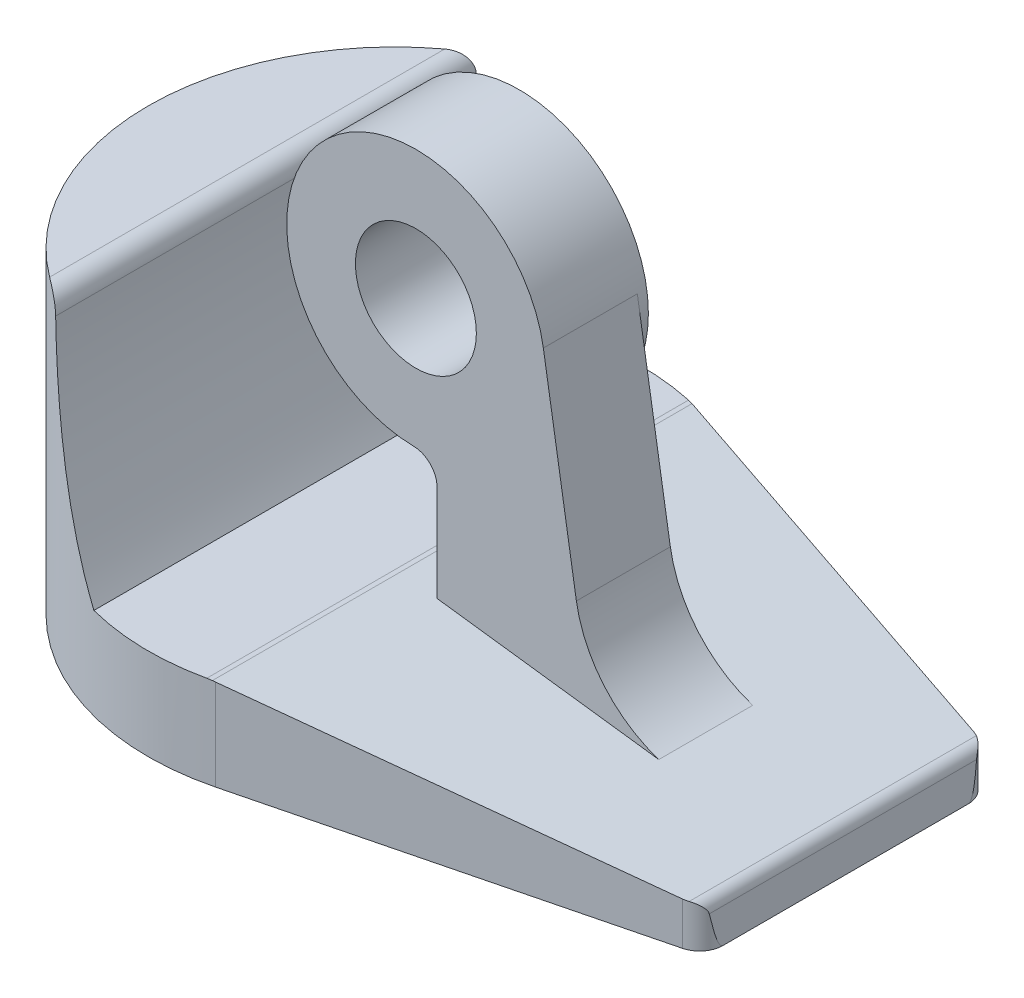
ISO-10303-21;
HEADER;
FILE_DESCRIPTION(('STEP AP214'),'2;1');
FILE_NAME('part.step','',(''),(''),'','','');
FILE_SCHEMA(('AUTOMOTIVE_DESIGN { 1 0 10303 214 1 1 1 1 }'));
ENDSEC;
DATA;
#1=APPLICATION_CONTEXT('core data for automotive mechanical design processes');
#2=APPLICATION_PROTOCOL_DEFINITION('international standard','automotive_design',2000,#1);
#3=PRODUCT_CONTEXT('',#1,'mechanical');
#4=PRODUCT('Part','Part','',(#3));
#5=PRODUCT_RELATED_PRODUCT_CATEGORY('part','',(#4));
#6=PRODUCT_DEFINITION_FORMATION('','',#4);
#7=PRODUCT_DEFINITION_CONTEXT('part definition',#1,'design');
#8=PRODUCT_DEFINITION('design','',#6,#7);
#9=PRODUCT_DEFINITION_SHAPE('','',#8);
#10=(LENGTH_UNIT() NAMED_UNIT(*) SI_UNIT(.MILLI.,.METRE.));
#11=(NAMED_UNIT(*) PLANE_ANGLE_UNIT() SI_UNIT($,.RADIAN.));
#12=(NAMED_UNIT(*) SI_UNIT($,.STERADIAN.) SOLID_ANGLE_UNIT());
#13=UNCERTAINTY_MEASURE_WITH_UNIT(LENGTH_MEASURE(1.E-05),#10,'distance_accuracy_value','');
#14=(GEOMETRIC_REPRESENTATION_CONTEXT(3) GLOBAL_UNCERTAINTY_ASSIGNED_CONTEXT((#13)) GLOBAL_UNIT_ASSIGNED_CONTEXT((#10,
#11,#12)) REPRESENTATION_CONTEXT('',''));
#15=CARTESIAN_POINT('',(0.,0.,0.));
#16=DIRECTION('',(0.,0.,1.));
#17=DIRECTION('',(1.,0.,0.));
#18=AXIS2_PLACEMENT_3D('',#15,#16,#17);
#19=CARTESIAN_POINT('',(18.2,13.5,-5.22027619321904));
#20=DIRECTION('',(0.,-1.,0.));
#21=DIRECTION('',(0.,0.,-1.));
#22=AXIS2_PLACEMENT_3D('',#19,#20,#21);
#23=CYLINDRICAL_SURFACE('',#22,1.);
#24=DIRECTION('',(0.,-1.,0.));
#25=VECTOR('',#24,1.);
#26=CARTESIAN_POINT('',(18.4438049071561,13.5,-6.19010049031962));
#27=LINE('',#26,#25);
#28=CARTESIAN_POINT('',(18.4438049071561,1.82131154060012,-6.19010049031962));
#29=VERTEX_POINT('',#28);
#30=CARTESIAN_POINT('',(18.4438049071561,0.,-6.19010049031962));
#31=VERTEX_POINT('',#30);
#32=EDGE_CURVE('E319',#29,#31,#27,.T.);
#33=ORIENTED_EDGE('',*,*,#32,.F.);
#34=CARTESIAN_POINT('',(18.2,1.85280157355218,-5.22027619321904));
#35=DIRECTION('',(0.128096716222587,0.991761680694001,0.));
#36=DIRECTION('',(0.991761680694001,-0.128096716222587,0.));
#37=AXIS2_PLACEMENT_3D('',#34,#35,#36);
#38=ELLIPSE('',#37,1.00830675298952,1.);
#39=CARTESIAN_POINT('',(18.6484912558825,1.7948740913239,-6.11406341252629));
#40=VERTEX_POINT('',#39);
#41=EDGE_CURVE('E342',#29,#40,#38,.F.);
#42=ORIENTED_EDGE('',*,*,#41,.T.);
#43=CARTESIAN_POINT('',(18.6484912558825,1.7948740913239,-6.11406341252629));
#44=CARTESIAN_POINT('',(18.6802676129442,1.79074901067277,-6.09815542671605));
#45=CARTESIAN_POINT('',(18.7107233065118,1.78373787800668,-6.08071969067226));
#46=CARTESIAN_POINT('',(18.7683849811915,1.76491260999379,-6.04373461692573));
#47=CARTESIAN_POINT('',(18.7956151729706,1.7531376360733,-6.02420344449918));
#48=CARTESIAN_POINT('',(18.8466077166445,1.72573024483383,-5.98379343671604));
#49=CARTESIAN_POINT('',(18.8703874634633,1.71011832770781,-5.96292218530723));
#50=CARTESIAN_POINT('',(18.914685670437,1.67546780161733,-5.92039574203116));
#51=CARTESIAN_POINT('',(18.9351931031517,1.65641804852345,-5.89873818927017));
#52=CARTESIAN_POINT('',(18.9733588637056,1.61454296963424,-5.85492945364332));
#53=CARTESIAN_POINT('',(18.9909198184742,1.5916258373714,-5.83278170476259));
#54=CARTESIAN_POINT('',(19.0223247126766,1.54213890051699,-5.78990524166017));
#55=CARTESIAN_POINT('',(19.0361748928987,1.51557534376584,-5.76917418914955));
#56=CARTESIAN_POINT('',(19.0540893086702,1.4713505568154,-5.74053925191339));
#57=CARTESIAN_POINT('',(19.0597099665848,1.45528980528271,-5.73115181826062));
#58=CARTESIAN_POINT('',(19.0694436228249,1.42177695151179,-5.71440200051831));
#59=CARTESIAN_POINT('',(19.0735654828219,1.40433379542986,-5.70702778010123));
#60=CARTESIAN_POINT('',(19.0780270417698,1.37915850427591,-5.69889461452841));
#61=CARTESIAN_POINT('',(19.0791420216045,1.37197549780757,-5.69684065512729));
#62=CARTESIAN_POINT('',(19.0810733742744,1.3574097308086,-5.69325991760886));
#63=CARTESIAN_POINT('',(19.0818885325434,1.35002628512667,-5.69173528514345));
#64=CARTESIAN_POINT('',(19.082540246817,1.34257112235073,-5.6905130619864));
#65=B_SPLINE_CURVE_WITH_KNOTS('',3,(#43,#44,#45,#46,#47,#48,#49,#50,#51,#52,#53,#54,#55,#56,#57,
#58,#59,#60,#61,#62,#63,#64),.UNSPECIFIED.,.F.,.F.,(4,2,2,2,2,2,2,2,2,2,4),(0.,
0.106921875411762,0.212982096306403,0.31848752408047,0.424341312139109,0.533199185529856,
0.641872815654457,0.7000382821374,0.757854026495124,0.780491057934941,0.803218806704113),.UNSPECIFIED.);
#66=CARTESIAN_POINT('',(19.082540246817,1.34257112235073,-5.69051306198637));
#67=VERTEX_POINT('',#66);
#68=EDGE_CURVE('E290',#40,#67,#65,.T.);
#69=ORIENTED_EDGE('',*,*,#68,.T.);
#70=CARTESIAN_POINT('',(18.2,11.4300523027615,-5.22027619321904));
#71=DIRECTION('',(0.996194698091746,0.0871557427476574,0.));
#72=DIRECTION('',(0.0871557427476574,-0.996194698091746,0.));
#73=AXIS2_PLACEMENT_3D('',#70,#71,#72);
#74=ELLIPSE('',#73,11.47371324567,1.);
#75=CARTESIAN_POINT('',(19.2,0.,-5.22027619321904));
#76=VERTEX_POINT('',#75);
#77=EDGE_CURVE('E224',#67,#76,#74,.F.);
#78=ORIENTED_EDGE('',*,*,#77,.T.);
#79=CARTESIAN_POINT('',(18.2,0.,-5.22027619321904));
#80=DIRECTION('',(0.,1.,0.));
#81=DIRECTION('',(0.,0.,1.));
#82=AXIS2_PLACEMENT_3D('',#79,#80,#81);
#83=CIRCLE('',#82,1.);
#84=EDGE_CURVE('E339',#31,#76,#83,.F.);
#85=ORIENTED_EDGE('',*,*,#84,.F.);
#86=EDGE_LOOP('',(#33,#42,#69,#78,#85));
#87=FACE_BOUND('',#86,.T.);
#88=ADVANCED_FACE('F36',(#87),#23,.T.);
#89=CARTESIAN_POINT('',(2.55995152513875,13.5,-10.183155119556));
#90=DIRECTION('',(0.243804907156071,0.,-0.969824297100573));
#91=DIRECTION('',(-0.969824297100573,0.,-0.243804907156071));
#92=AXIS2_PLACEMENT_3D('',#89,#90,#91);
#93=PLANE('',#92);
#94=DIRECTION('',(0.,-1.,0.));
#95=VECTOR('',#94,1.);
#96=CARTESIAN_POINT('',(2.55995152513875,13.5,-10.183155119556));
#97=LINE('',#96,#95);
#98=CARTESIAN_POINT('',(2.55995152513875,3.87288249641045,-10.183155119556));
#99=VERTEX_POINT('',#98);
#100=CARTESIAN_POINT('',(2.55995152513875,0.,-10.183155119556));
#101=VERTEX_POINT('',#100);
#102=EDGE_CURVE('E311',#99,#101,#97,.T.);
#103=ORIENTED_EDGE('',*,*,#102,.F.);
#104=DIRECTION('',(0.962303981373075,-0.124291936683371,0.241914368959401));
#105=VECTOR('',#104,1.);
#106=CARTESIAN_POINT('',(1.4084844870212,4.02160688180734,-10.4726233409244));
#107=LINE('',#106,#105);
#108=EDGE_CURVE('E312',#99,#29,#107,.T.);
#109=ORIENTED_EDGE('',*,*,#108,.T.);
#110=ORIENTED_EDGE('',*,*,#32,.T.);
#111=DIRECTION('',(0.969824297100573,0.,0.243804907156071));
#112=VECTOR('',#111,1.);
#113=CARTESIAN_POINT('',(2.55995152513875,0.,-10.183155119556));
#114=LINE('',#113,#112);
#115=EDGE_CURVE('E315',#101,#31,#114,.T.);
#116=ORIENTED_EDGE('',*,*,#115,.F.);
#117=EDGE_LOOP('',(#103,#109,#110,#116));
#118=FACE_BOUND('',#117,.T.);
#119=ADVANCED_FACE('F300',(#118),#93,.T.);
#120=CARTESIAN_POINT('',(0.,13.5,0.));
#121=DIRECTION('',(0.,-1.,0.));
#122=DIRECTION('',(0.,0.,-1.));
#123=AXIS2_PLACEMENT_3D('',#120,#121,#122);
#124=CYLINDRICAL_SURFACE('',#123,10.5);
#125=CARTESIAN_POINT('',(-6.28259423957447,13.5,8.41302618686438));
#126=CARTESIAN_POINT('',(-6.22838677976301,13.5000100237203,8.45354789799117));
#127=CARTESIAN_POINT('',(-6.17358027222726,13.4944805880455,8.49361920768717));
#128=CARTESIAN_POINT('',(-6.0645213878592,13.4717295940595,8.57180975410207));
#129=CARTESIAN_POINT('',(-6.01027444403453,13.4544367916504,8.60991556526101));
#130=CARTESIAN_POINT('',(-5.91633017160274,13.4126591942212,8.67465193061006));
#131=CARTESIAN_POINT('',(-5.87604475329094,13.3905732661252,8.70196993223101));
#132=CARTESIAN_POINT('',(-5.79874733441117,13.3387853413211,8.75366611506213));
#133=CARTESIAN_POINT('',(-5.76172582668327,13.3091065180774,8.77805291517515));
#134=CARTESIAN_POINT('',(-5.69762479858476,13.2472557554305,8.81976849149014));
#135=CARTESIAN_POINT('',(-5.66988576236114,13.2161134164486,8.83760751606915));
#136=CARTESIAN_POINT('',(-5.61896505553764,13.1487503936941,8.87007011856827));
#137=CARTESIAN_POINT('',(-5.59578557886508,13.1125272794904,8.88469214896334));
#138=CARTESIAN_POINT('',(-5.55503586872397,13.0355141558403,8.91022794398512));
#139=CARTESIAN_POINT('',(-5.53750268456487,12.9946962625693,8.9211172444018));
#140=CARTESIAN_POINT('',(-5.50934089131604,12.9099113078166,8.93853692311921));
#141=CARTESIAN_POINT('',(-5.4986959706511,12.8659519617818,8.94507760008262));
#142=CARTESIAN_POINT('',(-5.48964422682209,12.8069668124197,8.95063187692149));
#143=CARTESIAN_POINT('',(-5.4878374759623,12.7925897940214,8.95173962239731));
#144=CARTESIAN_POINT('',(-5.48500754406576,12.7637505761031,8.95347392494794));
#145=CARTESIAN_POINT('',(-5.48398326042964,12.7492885254908,8.95410115912999));
#146=CARTESIAN_POINT('',(-5.48335128244866,12.7347950497174,8.95448818823668));
#147=B_SPLINE_CURVE_WITH_KNOTS('',3,(#125,#126,#127,#128,#129,#130,#131,#132,#133,#134,#135,
#136,#137,#138,#139,#140,#141,#142,#143,#144,#145,#146),.UNSPECIFIED.,.F.,.F.,(4,2,2,2,2,2,2,2,
2,2,4),(0.,0.203158079580191,0.407557658697143,0.567270721287266,0.726502037710801,
0.862018752737931,0.997600515810359,1.13405460948635,1.27018438248779,1.31376006553652,
1.35727423086148),.UNSPECIFIED.);
#148=CARTESIAN_POINT('',(-6.28259423957447,13.5,8.41302618686437));
#149=VERTEX_POINT('',#148);
#150=CARTESIAN_POINT('',(-5.48335128244869,12.7347950497174,8.95448818823658));
#151=VERTEX_POINT('',#150);
#152=EDGE_CURVE('E227',#149,#151,#147,.T.);
#153=ORIENTED_EDGE('',*,*,#152,.F.);
#154=CARTESIAN_POINT('',(0.,13.5,0.));
#155=DIRECTION('',(0.,1.,0.));
#156=DIRECTION('',(0.,0.,1.));
#157=AXIS2_PLACEMENT_3D('',#154,#155,#156);
#158=CIRCLE('',#157,10.5);
#159=CARTESIAN_POINT('',(-6.28259423957447,13.5,-8.41302618686438));
#160=VERTEX_POINT('',#159);
#161=EDGE_CURVE('E326',#160,#149,#158,.T.);
#162=ORIENTED_EDGE('',*,*,#161,.F.);
#163=CARTESIAN_POINT('',(-5.48335128244869,12.7347950497174,-8.95448818823658));
#164=CARTESIAN_POINT('',(-5.48423041252916,12.755019421366,-8.95394940677135));
#165=CARTESIAN_POINT('',(-5.48587940913325,12.7751866366907,-8.95293993078877));
#166=CARTESIAN_POINT('',(-5.49068441215923,12.8152646603904,-8.94999409351274));
#167=CARTESIAN_POINT('',(-5.493839841248,12.8351755639962,-8.94805808730692));
#168=CARTESIAN_POINT('',(-5.50547633742162,12.8941197748488,-8.94090684337089));
#169=CARTESIAN_POINT('',(-5.5161379471259,12.9325871702279,-8.93434216722587));
#170=CARTESIAN_POINT('',(-5.54271414443501,13.0068112739797,-8.91787871490065));
#171=CARTESIAN_POINT('',(-5.55862302302979,13.0425708766582,-8.90798356202921));
#172=CARTESIAN_POINT('',(-5.59497373804368,13.1106945638693,-8.8851971356976));
#173=CARTESIAN_POINT('',(-5.61541983676291,13.1430554131928,-8.87230304445991));
#174=CARTESIAN_POINT('',(-5.66130369371461,13.2055555735564,-8.84310009641031));
#175=CARTESIAN_POINT('',(-5.68696031262574,13.2354614096642,-8.82663793120061));
#176=CARTESIAN_POINT('',(-5.74147386934782,13.2905002540825,-8.7912760244573));
#177=CARTESIAN_POINT('',(-5.77033119731696,13.3156326795116,-8.77237598570733));
#178=CARTESIAN_POINT('',(-5.83473412370199,13.3642864542767,-8.72969488276405));
#179=CARTESIAN_POINT('',(-5.8706438628524,13.3870514911532,-8.70560306581393));
#180=CARTESIAN_POINT('',(-5.9444778391105,13.4262424763794,-8.6553559858595));
#181=CARTESIAN_POINT('',(-5.98240510886939,13.4426585563957,-8.62919758610136));
#182=CARTESIAN_POINT('',(-6.06389884605276,13.4708745863564,-8.57215666017704));
#183=CARTESIAN_POINT('',(-6.10759942029934,13.4818930768423,-8.54108233429341));
#184=CARTESIAN_POINT('',(-6.19517440014582,13.4964410423102,-8.47778237033666));
#185=CARTESIAN_POINT('',(-6.23904757319125,13.4999979432651,-8.44556139282195));
#186=CARTESIAN_POINT('',(-6.28259423957447,13.5,-8.41302618686437));
#187=B_SPLINE_CURVE_WITH_KNOTS('',3,(#163,#164,#165,#166,#167,#168,#169,#170,#171,#172,#173,
#174,#175,#176,#177,#178,#179,#180,#181,#182,#183,#184,#185,#186),.UNSPECIFIED.,.F.,.F.,(4,2,2,
2,2,2,2,2,2,2,2,4),(0.,0.060710509345558,0.121397770330857,0.242112806859486,0.362696936717223,
0.483394827428391,0.611007297422337,0.738635340178701,0.884687516082472,1.03096580063039,
1.19464556912115,1.35772265110047),.UNSPECIFIED.);
#188=CARTESIAN_POINT('',(-5.48335128244869,12.7347950497174,-8.95448818823658));
#189=VERTEX_POINT('',#188);
#190=EDGE_CURVE('E234',#189,#160,#187,.T.);
#191=ORIENTED_EDGE('',*,*,#190,.F.);
#192=CARTESIAN_POINT('',(-2.65,3.9,-10.1600935035067));
#193=CARTESIAN_POINT('',(-2.89237739770949,4.27225938122749,-10.096842857572));
#194=CARTESIAN_POINT('',(-3.12020843354723,4.65296504188959,-10.0281883219219));
#195=CARTESIAN_POINT('',(-3.54616903615586,5.4298041194384,-9.88561120247265));
#196=CARTESIAN_POINT('',(-3.74429320026349,5.82594032615018,-9.81168766402008));
#197=CARTESIAN_POINT('',(-4.10633333468622,6.62364573315424,-9.66567564937164));
#198=CARTESIAN_POINT('',(-4.27087577447494,7.02492998930813,-9.59358101751967));
#199=CARTESIAN_POINT('',(-4.57011468528249,7.83933215007696,-9.4546967965165));
#200=CARTESIAN_POINT('',(-4.70481698078757,8.2524477275319,-9.38790617371347));
#201=CARTESIAN_POINT('',(-4.91733449023907,8.99691379841309,-9.27797400479081));
#202=CARTESIAN_POINT('',(-5.00114559212044,9.32627139434346,-9.23286154957257));
#203=CARTESIAN_POINT('',(-5.14970901358315,9.99021105591854,-9.15083097489157));
#204=CARTESIAN_POINT('',(-5.21446535043033,10.3247920046512,-9.11391112860683));
#205=CARTESIAN_POINT('',(-5.32543800465306,11.0036088684344,-9.04952574659564));
#206=CARTESIAN_POINT('',(-5.37133519011071,11.3479132812729,-9.02222398317647));
#207=CARTESIAN_POINT('',(-5.42487079988006,11.8665469645826,-8.99006080657434));
#208=CARTESIAN_POINT('',(-5.44016704931032,12.0398503488597,-8.98080291445126));
#209=CARTESIAN_POINT('',(-5.46562031250365,12.3869775956263,-8.9653332162485));
#210=CARTESIAN_POINT('',(-5.47577708369301,12.5608014822932,-8.95912155394556));
#211=CARTESIAN_POINT('',(-5.48335128244869,12.7347950497174,-8.95448818823664));
#212=B_SPLINE_CURVE_WITH_KNOTS('',3,(#192,#193,#194,#195,#196,#197,#198,#199,#200,#201,#202,
#203,#204,#205,#206,#207,#208,#209,#210,#211),.UNSPECIFIED.,.F.,.F.,(4,2,2,2,2,2,2,2,2,4),(0.,
1.34561648499748,2.69147739552455,4.00931041819144,5.32688598644845,6.35477391978285,
7.38244499069429,8.42685338909804,8.94943316685275,9.47203760709035),.UNSPECIFIED.);
#213=CARTESIAN_POINT('',(-2.65,3.9,-10.1600935035067));
#214=VERTEX_POINT('',#213);
#215=EDGE_CURVE('E366',#214,#189,#212,.T.);
#216=ORIENTED_EDGE('',*,*,#215,.F.);
#217=CARTESIAN_POINT('',(0.,3.9,0.));
#218=DIRECTION('',(0.,1.,0.));
#219=DIRECTION('',(-1.,0.,0.));
#220=AXIS2_PLACEMENT_3D('',#217,#218,#219);
#221=CIRCLE('',#220,10.5);
#222=CARTESIAN_POINT('',(2.25353008786326,3.9,-10.2553206748056));
#223=VERTEX_POINT('',#222);
#224=EDGE_CURVE('E362',#223,#214,#221,.T.);
#225=ORIENTED_EDGE('',*,*,#224,.F.);
#226=CARTESIAN_POINT('',(2.44567516219714,3.887642521041,-10.2112033081813));
#227=CARTESIAN_POINT('',(2.41384546311767,3.8917555558298,-10.2188280421213));
#228=CARTESIAN_POINT('',(2.38191852405007,3.89484186313745,-10.2263168563101));
#229=CARTESIAN_POINT('',(2.31787016593878,3.89896102279045,-10.2410226451848));
#230=CARTESIAN_POINT('',(2.28574874689508,3.8999938751358,-10.2482396198709));
#231=CARTESIAN_POINT('',(2.25353008786326,3.90000000000001,-10.2553206748056));
#232=B_SPLINE_CURVE_WITH_KNOTS('',3,(#226,#227,#228,#229,#230,#231),.UNSPECIFIED.,.F.,.F.,(4,2,
4),(0.,0.0988151487414125,0.19763029748241),.UNSPECIFIED.);
#233=CARTESIAN_POINT('',(2.44567516219714,3.887642521041,-10.2112033081813));
#234=VERTEX_POINT('',#233);
#235=EDGE_CURVE('E361',#234,#223,#232,.T.);
#236=ORIENTED_EDGE('',*,*,#235,.F.);
#237=CARTESIAN_POINT('',(0.,4.20352784240709,0.));
#238=DIRECTION('',(0.128096716222587,0.991761680694001,0.));
#239=DIRECTION('',(0.991761680694001,-0.128096716222587,0.));
#240=AXIS2_PLACEMENT_3D('',#237,#238,#239);
#241=ELLIPSE('',#240,10.58722090639,10.5);
#242=EDGE_CURVE('E346',#99,#234,#241,.T.);
#243=ORIENTED_EDGE('',*,*,#242,.F.);
#244=ORIENTED_EDGE('',*,*,#102,.T.);
#245=CARTESIAN_POINT('',(0.,0.,0.));
#246=DIRECTION('',(0.,1.,0.));
#247=DIRECTION('',(0.,0.,1.));
#248=AXIS2_PLACEMENT_3D('',#245,#246,#247);
#249=CIRCLE('',#248,10.5);
#250=CARTESIAN_POINT('',(2.55995152513875,0.,10.183155119556));
#251=VERTEX_POINT('',#250);
#252=EDGE_CURVE('E336',#101,#251,#249,.T.);
#253=ORIENTED_EDGE('',*,*,#252,.T.);
#254=DIRECTION('',(0.,-1.,0.));
#255=VECTOR('',#254,1.);
#256=CARTESIAN_POINT('',(2.55995152513875,13.5,10.183155119556));
#257=LINE('',#256,#255);
#258=CARTESIAN_POINT('',(2.55995152513875,3.87288249641045,10.183155119556));
#259=VERTEX_POINT('',#258);
#260=EDGE_CURVE('E320',#259,#251,#257,.T.);
#261=ORIENTED_EDGE('',*,*,#260,.F.);
#262=CARTESIAN_POINT('',(2.44567516219714,3.887642521041,10.2112033081813));
#263=VERTEX_POINT('',#262);
#264=EDGE_CURVE('E347',#263,#259,#241,.T.);
#265=ORIENTED_EDGE('',*,*,#264,.F.);
#266=CARTESIAN_POINT('',(2.25353008786326,3.9,10.2553206748056));
#267=CARTESIAN_POINT('',(2.28574874689508,3.89999387513579,10.2482396198709));
#268=CARTESIAN_POINT('',(2.31787016593878,3.89896102279044,10.2410226451848));
#269=CARTESIAN_POINT('',(2.38191852405007,3.89484186313746,10.2263168563101));
#270=CARTESIAN_POINT('',(2.41384546311767,3.8917555558298,10.2188280421213));
#271=CARTESIAN_POINT('',(2.44567516219714,3.887642521041,10.2112033081813));
#272=B_SPLINE_CURVE_WITH_KNOTS('',3,(#266,#267,#268,#269,#270,#271),.UNSPECIFIED.,.F.,.F.,(4,2,
4),(0.,0.0988151487409988,0.197630297482412),.UNSPECIFIED.);
#273=CARTESIAN_POINT('',(2.25353008786326,3.9,10.2553206748056));
#274=VERTEX_POINT('',#273);
#275=EDGE_CURVE('E379',#274,#263,#272,.T.);
#276=ORIENTED_EDGE('',*,*,#275,.F.);
#277=CARTESIAN_POINT('',(-2.65,3.9,10.1600935035067));
#278=VERTEX_POINT('',#277);
#279=EDGE_CURVE('E368',#278,#274,#221,.T.);
#280=ORIENTED_EDGE('',*,*,#279,.F.);
#281=CARTESIAN_POINT('',(-5.48335128244869,12.7347950497174,8.95448818823657));
#282=CARTESIAN_POINT('',(-5.47355702550274,12.5097130886613,8.96046903611428));
#283=CARTESIAN_POINT('',(-5.45943355604728,12.2848996478618,8.96911200117412));
#284=CARTESIAN_POINT('',(-5.4226006640974,11.8362515155291,8.99143730121418));
#285=CARTESIAN_POINT('',(-5.39989216370003,11.6124167214928,9.00511909498214));
#286=CARTESIAN_POINT('',(-5.3459839753329,11.1663212124301,9.03722404669327));
#287=CARTESIAN_POINT('',(-5.31479199767201,10.9440592552043,9.05564289848245));
#288=CARTESIAN_POINT('',(-5.24400931068921,10.5012921407416,9.09681464683853));
#289=CARTESIAN_POINT('',(-5.20441844309455,10.2807870166925,9.11956762507899));
#290=CARTESIAN_POINT('',(-5.07496904058514,9.63127224626168,9.1926301608044));
#291=CARTESIAN_POINT('',(-4.97332283334207,9.20516839002024,9.24843595077005));
#292=CARTESIAN_POINT('',(-4.73905648125785,8.36314859530489,9.37063191089226));
#293=CARTESIAN_POINT('',(-4.60643293961607,7.94723377963411,9.43702324154624));
#294=CARTESIAN_POINT('',(-4.34463378914422,7.22049415818097,9.55981307124812));
#295=CARTESIAN_POINT('',(-4.22152564938398,6.90726949757299,9.61505311529336));
#296=CARTESIAN_POINT('',(-3.95767028549549,6.28862100802398,9.72663124469442));
#297=CARTESIAN_POINT('',(-3.81692713140902,5.98319539863152,9.78296907416332));
#298=CARTESIAN_POINT('',(-3.51567590165147,5.37588183878299,9.89526610507305));
#299=CARTESIAN_POINT('',(-3.35488693746412,5.07412927381155,9.95120472862685));
#300=CARTESIAN_POINT('',(-3.01562625287824,4.47989999746502,10.0592066036168));
#301=CARTESIAN_POINT('',(-2.83714921274317,4.18742611180409,10.1112686808761));
#302=CARTESIAN_POINT('',(-2.65,3.9,10.1600935035067));
#303=B_SPLINE_CURVE_WITH_KNOTS('',3,(#281,#282,#283,#284,#285,#286,#287,#288,#289,#290,#291,
#292,#293,#294,#295,#296,#297,#298,#299,#300,#301,#302),.UNSPECIFIED.,.F.,.F.,(4,2,2,2,2,2,2,2,
2,2,4),(0.,0.676051307687673,1.35203002298913,2.02739640829444,2.70277552166311,
4.02605496876232,5.3494795874364,6.3721095701907,7.39450397010714,8.4333022558415,
9.47241391656499),.UNSPECIFIED.);
#304=EDGE_CURVE('E387',#151,#278,#303,.T.);
#305=ORIENTED_EDGE('',*,*,#304,.F.);
#306=EDGE_LOOP('',(#153,#162,#191,#216,#225,#236,#243,#244,#253,#261,#265,#276,#280,#305));
#307=FACE_BOUND('',#306,.T.);
#308=ADVANCED_FACE('F239',(#307),#124,.T.);
#309=CARTESIAN_POINT('',(2.55995152513874,13.5,10.183155119556));
#310=DIRECTION('',(0.243804907156071,0.,0.969824297100573));
#311=DIRECTION('',(0.969824297100573,0.,-0.243804907156071));
#312=AXIS2_PLACEMENT_3D('',#309,#310,#311);
#313=PLANE('',#312);
#314=DIRECTION('',(0.,-1.,0.));
#315=VECTOR('',#314,1.);
#316=CARTESIAN_POINT('',(18.4438049071561,13.5,6.19010049031961));
#317=LINE('',#316,#315);
#318=CARTESIAN_POINT('',(18.4438049071561,1.82131154060012,6.19010049031961));
#319=VERTEX_POINT('',#318);
#320=CARTESIAN_POINT('',(18.4438049071561,0.,6.19010049031961));
#321=VERTEX_POINT('',#320);
#322=EDGE_CURVE('E322',#319,#321,#317,.T.);
#323=ORIENTED_EDGE('',*,*,#322,.F.);
#324=DIRECTION('',(-0.962303981373075,0.124291936683371,0.241914368959401));
#325=VECTOR('',#324,1.);
#326=CARTESIAN_POINT('',(1.4084844870212,4.02160688180734,10.4726233409244));
#327=LINE('',#326,#325);
#328=EDGE_CURVE('E296',#319,#259,#327,.T.);
#329=ORIENTED_EDGE('',*,*,#328,.T.);
#330=ORIENTED_EDGE('',*,*,#260,.T.);
#331=DIRECTION('',(-0.969824297100573,0.,0.243804907156071));
#332=VECTOR('',#331,1.);
#333=CARTESIAN_POINT('',(2.55995152513874,0.,10.183155119556));
#334=LINE('',#333,#332);
#335=EDGE_CURVE('E333',#321,#251,#334,.T.);
#336=ORIENTED_EDGE('',*,*,#335,.F.);
#337=EDGE_LOOP('',(#323,#329,#330,#336));
#338=FACE_BOUND('',#337,.T.);
#339=ADVANCED_FACE('F266',(#338),#313,.T.);
#340=CARTESIAN_POINT('',(18.2,13.5,5.22027619321904));
#341=DIRECTION('',(0.,-1.,0.));
#342=DIRECTION('',(0.,0.,-1.));
#343=AXIS2_PLACEMENT_3D('',#340,#341,#342);
#344=CYLINDRICAL_SURFACE('',#343,1.);
#345=CARTESIAN_POINT('',(19.082540246817,1.34257112235073,5.69051306198639));
#346=CARTESIAN_POINT('',(19.0809217445931,1.36107915597881,5.69354632465262));
#347=CARTESIAN_POINT('',(19.0783158791309,1.37900287021135,5.69840941516929));
#348=CARTESIAN_POINT('',(19.0715037512144,1.41332591120479,5.71071473998299));
#349=CARTESIAN_POINT('',(19.067322754372,1.42974446360726,5.71811609971433));
#350=CARTESIAN_POINT('',(19.0549360824653,1.47018593386494,5.73922089576665));
#351=CARTESIAN_POINT('',(19.0457912064813,1.49326311188743,5.754122119124));
#352=CARTESIAN_POINT('',(19.0248583580397,1.53695263491911,5.78594387194478));
#353=CARTESIAN_POINT('',(19.0130446146178,1.55753772080748,5.80288328230811));
#354=CARTESIAN_POINT('',(18.9802745200936,1.60654092260777,5.84657696165573));
#355=CARTESIAN_POINT('',(18.9577594653274,1.63346162219039,5.8738520200305));
#356=CARTESIAN_POINT('',(18.907497412463,1.68220680877197,5.92795796913642));
#357=CARTESIAN_POINT('',(18.8797633040418,1.70404356067174,5.95478978065132));
#358=CARTESIAN_POINT('',(18.8250436447169,1.73824020320685,6.00152605392535));
#359=CARTESIAN_POINT('',(18.7989762840012,1.75161863027937,6.02175769190956));
#360=CARTESIAN_POINT('',(18.7437035406087,1.7738796306368,6.06022178286835));
#361=CARTESIAN_POINT('',(18.7145095255076,1.78277786191102,6.07846102159924));
#362=CARTESIAN_POINT('',(18.6723720667144,1.79134572355424,6.10177879695792));
#363=CARTESIAN_POINT('',(18.6605157717982,1.79332194980747,6.10803405133317));
#364=CARTESIAN_POINT('',(18.6484912558825,1.7948740913239,6.11406341252628));
#365=B_SPLINE_CURVE_WITH_KNOTS('',3,(#345,#346,#347,#348,#349,#350,#351,#352,#353,#354,#355,
#356,#357,#358,#359,#360,#361,#362,#363,#364),.UNSPECIFIED.,.F.,.F.,(4,2,2,2,2,2,2,2,2,4),(0.,
0.0560702876294425,0.111277043087514,0.197680626412082,0.284957186739713,0.417645733970969,
0.550010777251174,0.656439151311666,0.762492937438157,0.803112015267204),.UNSPECIFIED.);
#366=CARTESIAN_POINT('',(19.082540246817,1.34257112235073,5.69051306198642));
#367=VERTEX_POINT('',#366);
#368=CARTESIAN_POINT('',(18.6484912558825,1.7948740913239,6.11406341252628));
#369=VERTEX_POINT('',#368);
#370=EDGE_CURVE('E269',#367,#369,#365,.T.);
#371=ORIENTED_EDGE('',*,*,#370,.T.);
#372=CARTESIAN_POINT('',(18.2,1.85280157355218,5.22027619321904));
#373=DIRECTION('',(0.128096716222587,0.991761680694001,0.));
#374=DIRECTION('',(0.991761680694001,-0.128096716222587,0.));
#375=AXIS2_PLACEMENT_3D('',#372,#373,#374);
#376=ELLIPSE('',#375,1.00830675298952,1.);
#377=EDGE_CURVE('E277',#369,#319,#376,.F.);
#378=ORIENTED_EDGE('',*,*,#377,.T.);
#379=ORIENTED_EDGE('',*,*,#322,.T.);
#380=CARTESIAN_POINT('',(18.2,0.,5.22027619321904));
#381=DIRECTION('',(0.,1.,0.));
#382=DIRECTION('',(0.,0.,1.));
#383=AXIS2_PLACEMENT_3D('',#380,#381,#382);
#384=CIRCLE('',#383,1.);
#385=CARTESIAN_POINT('',(19.2,0.,5.22027619321904));
#386=VERTEX_POINT('',#385);
#387=EDGE_CURVE('E330',#386,#321,#384,.F.);
#388=ORIENTED_EDGE('',*,*,#387,.F.);
#389=CARTESIAN_POINT('',(18.2,11.4300523027615,5.22027619321904));
#390=DIRECTION('',(0.996194698091746,0.0871557427476574,0.));
#391=DIRECTION('',(0.0871557427476574,-0.996194698091746,0.));
#392=AXIS2_PLACEMENT_3D('',#389,#390,#391);
#393=ELLIPSE('',#392,11.47371324567,1.);
#394=EDGE_CURVE('E221',#386,#367,#393,.F.);
#395=ORIENTED_EDGE('',*,*,#394,.T.);
#396=EDGE_LOOP('',(#371,#378,#379,#388,#395));
#397=FACE_BOUND('',#396,.T.);
#398=ADVANCED_FACE('F259',(#397),#344,.T.);
#399=CARTESIAN_POINT('',(0.,13.5,0.));
#400=DIRECTION('',(0.,1.,0.));
#401=DIRECTION('',(0.,0.,1.));
#402=AXIS2_PLACEMENT_3D('',#399,#400,#401);
#403=PLANE('',#402);
#404=ORIENTED_EDGE('',*,*,#161,.T.);
#405=DIRECTION('',(0.,0.,-1.));
#406=VECTOR('',#405,1.);
#407=CARTESIAN_POINT('',(-6.28259423957447,13.5,56.2360147614063));
#408=LINE('',#407,#406);
#409=EDGE_CURVE('E278',#149,#160,#408,.T.);
#410=ORIENTED_EDGE('',*,*,#409,.T.);
#411=EDGE_LOOP('',(#404,#410));
#412=FACE_BOUND('',#411,.T.);
#413=ADVANCED_FACE('F254',(#412),#403,.T.);
#414=CARTESIAN_POINT('',(0.,0.,0.));
#415=DIRECTION('',(0.,1.,0.));
#416=DIRECTION('',(0.,0.,1.));
#417=AXIS2_PLACEMENT_3D('',#414,#415,#416);
#418=PLANE('',#417);
#419=ORIENTED_EDGE('',*,*,#84,.T.);
#420=DIRECTION('',(0.,0.,1.));
#421=VECTOR('',#420,1.);
#422=CARTESIAN_POINT('',(19.2,0.,0.));
#423=LINE('',#422,#421);
#424=EDGE_CURVE('E327',#76,#386,#423,.T.);
#425=ORIENTED_EDGE('',*,*,#424,.T.);
#426=ORIENTED_EDGE('',*,*,#387,.T.);
#427=ORIENTED_EDGE('',*,*,#335,.T.);
#428=ORIENTED_EDGE('',*,*,#252,.F.);
#429=ORIENTED_EDGE('',*,*,#115,.T.);
#430=EDGE_LOOP('',(#419,#425,#426,#427,#428,#429));
#431=FACE_BOUND('',#430,.T.);
#432=ADVANCED_FACE('F258',(#431),#418,.F.);
#433=CARTESIAN_POINT('',(12.0934210526316,13.5,56.2360147614063));
#434=DIRECTION('',(0.,0.,-1.));
#435=DIRECTION('',(-1.,0.,0.));
#436=AXIS2_PLACEMENT_3D('',#433,#434,#435);
#437=CYLINDRICAL_SURFACE('',#436,17.5934210526316);
#438=DIRECTION('',(0.,0.,-1.));
#439=VECTOR('',#438,1.);
#440=CARTESIAN_POINT('',(-5.48335128244869,12.7347950497174,56.2360147614063));
#441=LINE('',#440,#439);
#442=EDGE_CURVE('E218',#151,#189,#441,.T.);
#443=ORIENTED_EDGE('',*,*,#442,.F.);
#444=ORIENTED_EDGE('',*,*,#304,.T.);
#445=DIRECTION('',(0.,0.,-1.));
#446=VECTOR('',#445,1.);
#447=CARTESIAN_POINT('',(-2.65,3.90000000000001,56.2360147614063));
#448=LINE('',#447,#446);
#449=EDGE_CURVE('E215',#278,#214,#448,.T.);
#450=ORIENTED_EDGE('',*,*,#449,.T.);
#451=ORIENTED_EDGE('',*,*,#215,.T.);
#452=EDGE_LOOP('',(#443,#444,#450,#451));
#453=FACE_BOUND('',#452,.T.);
#454=ADVANCED_FACE('F251',(#453),#437,.F.);
#455=CARTESIAN_POINT('',(-2.65,3.9,56.2360147614063));
#456=DIRECTION('',(0.,1.,0.));
#457=DIRECTION('',(-1.,0.,0.));
#458=AXIS2_PLACEMENT_3D('',#455,#456,#457);
#459=PLANE('',#458);
#460=ORIENTED_EDGE('',*,*,#449,.F.);
#461=ORIENTED_EDGE('',*,*,#279,.T.);
#462=DIRECTION('',(0.,0.,-1.));
#463=VECTOR('',#462,1.);
#464=CARTESIAN_POINT('',(2.25353008786326,3.9,56.2360147614063));
#465=LINE('',#464,#463);
#466=EDGE_CURVE('E212',#274,#223,#465,.T.);
#467=ORIENTED_EDGE('',*,*,#466,.T.);
#468=ORIENTED_EDGE('',*,*,#224,.T.);
#469=EDGE_LOOP('',(#460,#461,#467,#468));
#470=FACE_BOUND('',#469,.T.);
#471=ADVANCED_FACE('F376',(#470),#459,.T.);
#472=CARTESIAN_POINT('',(2.25353008786326,2.4,56.2360147614063));
#473=DIRECTION('',(0.,0.,-1.));
#474=DIRECTION('',(-1.,0.,0.));
#475=AXIS2_PLACEMENT_3D('',#472,#473,#474);
#476=CYLINDRICAL_SURFACE('',#475,1.5);
#477=DIRECTION('',(0.,0.,-1.));
#478=VECTOR('',#477,1.);
#479=CARTESIAN_POINT('',(2.44567516219714,3.887642521041,56.2360147614063));
#480=LINE('',#479,#478);
#481=EDGE_CURVE('E209',#263,#234,#480,.T.);
#482=ORIENTED_EDGE('',*,*,#481,.T.);
#483=ORIENTED_EDGE('',*,*,#235,.T.);
#484=ORIENTED_EDGE('',*,*,#466,.F.);
#485=ORIENTED_EDGE('',*,*,#275,.T.);
#486=EDGE_LOOP('',(#482,#483,#484,#485));
#487=FACE_BOUND('',#486,.T.);
#488=ADVANCED_FACE('F373',(#487),#476,.T.);
#489=CARTESIAN_POINT('',(2.44567516219714,3.887642521041,56.2360147614063));
#490=DIRECTION('',(0.128096716222587,0.991761680694001,0.));
#491=DIRECTION('',(-0.991761680694001,0.128096716222587,0.));
#492=AXIS2_PLACEMENT_3D('',#489,#490,#491);
#493=PLANE('',#492);
#494=DIRECTION('',(0.991761680694001,-0.128096716222587,0.));
#495=VECTOR('',#494,1.);
#496=CARTESIAN_POINT('',(2.44567516219714,3.887642521041,2.2));
#497=LINE('',#496,#495);
#498=CARTESIAN_POINT('',(4.,3.68688470639502,2.2));
#499=VERTEX_POINT('',#498);
#500=CARTESIAN_POINT('',(13.4429189999899,2.46722988507934,2.2));
#501=VERTEX_POINT('',#500);
#502=EDGE_CURVE('E398',#499,#501,#497,.T.);
#503=ORIENTED_EDGE('',*,*,#502,.F.);
#504=DIRECTION('',(0.,0.,-1.));
#505=VECTOR('',#504,1.);
#506=CARTESIAN_POINT('',(4.,3.68688470639502,56.2360147614063));
#507=LINE('',#506,#505);
#508=CARTESIAN_POINT('',(4.,3.68688470639502,-1.8));
#509=VERTEX_POINT('',#508);
#510=EDGE_CURVE('E394',#499,#509,#507,.T.);
#511=ORIENTED_EDGE('',*,*,#510,.T.);
#512=DIRECTION('',(0.991761680694001,-0.128096716222587,0.));
#513=VECTOR('',#512,1.);
#514=CARTESIAN_POINT('',(2.44567516219714,3.887642521041,-1.8));
#515=LINE('',#514,#513);
#516=CARTESIAN_POINT('',(13.4429189999899,2.46722988507934,-1.8));
#517=VERTEX_POINT('',#516);
#518=EDGE_CURVE('E392',#509,#517,#515,.T.);
#519=ORIENTED_EDGE('',*,*,#518,.T.);
#520=DIRECTION('',(0.,0.,-1.));
#521=VECTOR('',#520,1.);
#522=CARTESIAN_POINT('',(13.4429189999899,2.46722988507934,2.2));
#523=LINE('',#522,#521);
#524=EDGE_CURVE('E183',#501,#517,#523,.T.);
#525=ORIENTED_EDGE('',*,*,#524,.F.);
#526=EDGE_LOOP('',(#503,#511,#519,#525));
#527=FACE_BOUND('',#526,.T.);
#528=ORIENTED_EDGE('',*,*,#41,.F.);
#529=ORIENTED_EDGE('',*,*,#108,.F.);
#530=ORIENTED_EDGE('',*,*,#242,.T.);
#531=ORIENTED_EDGE('',*,*,#481,.F.);
#532=ORIENTED_EDGE('',*,*,#264,.T.);
#533=ORIENTED_EDGE('',*,*,#328,.F.);
#534=ORIENTED_EDGE('',*,*,#377,.F.);
#535=DIRECTION('',(0.,0.,-1.));
#536=VECTOR('',#535,1.);
#537=CARTESIAN_POINT('',(18.6484912558825,1.7948740913239,56.2360147614063));
#538=LINE('',#537,#536);
#539=EDGE_CURVE('E206',#369,#40,#538,.T.);
#540=ORIENTED_EDGE('',*,*,#539,.T.);
#541=EDGE_LOOP('',(#528,#529,#530,#531,#532,#533,#534,#540));
#542=FACE_BOUND('',#541,.T.);
#543=ADVANCED_FACE('F249',(#527,#542),#493,.T.);
#544=CARTESIAN_POINT('',(-6.28259423957447,12.7,56.2360147614063));
#545=DIRECTION('',(0.,0.,-1.));
#546=DIRECTION('',(-1.,0.,0.));
#547=AXIS2_PLACEMENT_3D('',#544,#545,#546);
#548=CYLINDRICAL_SURFACE('',#547,0.799999999999998);
#549=ORIENTED_EDGE('',*,*,#442,.T.);
#550=ORIENTED_EDGE('',*,*,#190,.T.);
#551=ORIENTED_EDGE('',*,*,#409,.F.);
#552=ORIENTED_EDGE('',*,*,#152,.T.);
#553=EDGE_LOOP('',(#549,#550,#551,#552));
#554=FACE_BOUND('',#553,.T.);
#555=ADVANCED_FACE('F243',(#554),#548,.T.);
#556=CARTESIAN_POINT('',(18.5844428977712,1.2989932509769,56.2360147614063));
#557=DIRECTION('',(0.,0.,-1.));
#558=DIRECTION('',(-1.,0.,0.));
#559=AXIS2_PLACEMENT_3D('',#556,#557,#558);
#560=CYLINDRICAL_SURFACE('',#559,0.500000000000001);
#561=ORIENTED_EDGE('',*,*,#68,.F.);
#562=ORIENTED_EDGE('',*,*,#539,.F.);
#563=ORIENTED_EDGE('',*,*,#370,.F.);
#564=DIRECTION('',(0.,0.,-1.));
#565=VECTOR('',#564,1.);
#566=CARTESIAN_POINT('',(19.082540246817,1.34257112235073,56.2360147614063));
#567=LINE('',#566,#565);
#568=EDGE_CURVE('E170',#367,#67,#567,.T.);
#569=ORIENTED_EDGE('',*,*,#568,.T.);
#570=EDGE_LOOP('',(#561,#562,#563,#569));
#571=FACE_BOUND('',#570,.T.);
#572=ADVANCED_FACE('F248',(#571),#560,.T.);
#573=CARTESIAN_POINT('',(19.082540246817,1.34257112235073,56.2360147614063));
#574=DIRECTION('',(0.996194698091746,0.0871557427476574,0.));
#575=DIRECTION('',(-0.0871557427476574,0.996194698091746,0.));
#576=AXIS2_PLACEMENT_3D('',#573,#574,#575);
#577=PLANE('',#576);
#578=ORIENTED_EDGE('',*,*,#77,.F.);
#579=ORIENTED_EDGE('',*,*,#568,.F.);
#580=ORIENTED_EDGE('',*,*,#394,.F.);
#581=ORIENTED_EDGE('',*,*,#424,.F.);
#582=EDGE_LOOP('',(#578,#579,#580,#581));
#583=FACE_BOUND('',#582,.T.);
#584=ADVANCED_FACE('F285',(#583),#577,.T.);
#585=CARTESIAN_POINT('',(15.0481403663513,7.39365516579373,2.2));
#586=DIRECTION('',(0.,0.,-1.));
#587=DIRECTION('',(-1.,0.,0.));
#588=AXIS2_PLACEMENT_3D('',#585,#586,#587);
#589=CYLINDRICAL_SURFACE('',#588,5.18135133739115);
#590=CARTESIAN_POINT('',(15.0481403663513,7.39365516579373,2.2));
#591=DIRECTION('',(0.,0.,1.));
#592=DIRECTION('',(1.,0.,0.));
#593=AXIS2_PLACEMENT_3D('',#590,#591,#592);
#594=CIRCLE('',#593,5.18135133739115);
#595=CARTESIAN_POINT('',(9.93428712006275,6.56004455111279,2.2));
#596=VERTEX_POINT('',#595);
#597=EDGE_CURVE('E193',#596,#501,#594,.T.);
#598=ORIENTED_EDGE('',*,*,#597,.T.);
#599=ORIENTED_EDGE('',*,*,#524,.T.);
#600=CARTESIAN_POINT('',(15.0481403663513,7.39365516579373,-1.8));
#601=DIRECTION('',(0.,0.,1.));
#602=DIRECTION('',(1.,0.,0.));
#603=AXIS2_PLACEMENT_3D('',#600,#601,#602);
#604=CIRCLE('',#603,5.18135133739115);
#605=CARTESIAN_POINT('',(9.93428712006275,6.56004455111279,-1.8));
#606=VERTEX_POINT('',#605);
#607=EDGE_CURVE('E177',#606,#517,#604,.T.);
#608=ORIENTED_EDGE('',*,*,#607,.F.);
#609=DIRECTION('',(0.,0.,-1.));
#610=VECTOR('',#609,1.);
#611=CARTESIAN_POINT('',(9.93428712006275,6.56004455111279,2.2));
#612=LINE('',#611,#610);
#613=EDGE_CURVE('E160',#596,#606,#612,.T.);
#614=ORIENTED_EDGE('',*,*,#613,.F.);
#615=EDGE_LOOP('',(#598,#599,#608,#614));
#616=FACE_BOUND('',#615,.T.);
#617=ADVANCED_FACE('F181',(#616),#589,.F.);
#618=CARTESIAN_POINT('',(10.7188176102671,1.74727738681832,2.2));
#619=DIRECTION('',(0.986972878944637,0.160886718618209,0.));
#620=DIRECTION('',(-0.160886718618209,0.986972878944637,0.));
#621=AXIS2_PLACEMENT_3D('',#618,#619,#620);
#622=PLANE('',#621);
#623=ORIENTED_EDGE('',*,*,#613,.T.);
#624=DIRECTION('',(0.160886718618209,-0.986972878944637,0.));
#625=VECTOR('',#624,1.);
#626=CARTESIAN_POINT('',(10.7188176102671,1.74727738681832,-1.8));
#627=LINE('',#626,#625);
#628=CARTESIAN_POINT('',(8.5283508341955,15.1848769524002,-1.8));
#629=VERTEX_POINT('',#628);
#630=EDGE_CURVE('E163',#629,#606,#627,.T.);
#631=ORIENTED_EDGE('',*,*,#630,.F.);
#632=DIRECTION('',(0.,0.,-1.));
#633=VECTOR('',#632,1.);
#634=CARTESIAN_POINT('',(8.5283508341955,15.1848769524002,2.2));
#635=LINE('',#634,#633);
#636=CARTESIAN_POINT('',(8.5283508341955,15.1848769524002,2.2));
#637=VERTEX_POINT('',#636);
#638=EDGE_CURVE('E171',#637,#629,#635,.T.);
#639=ORIENTED_EDGE('',*,*,#638,.F.);
#640=DIRECTION('',(0.160886718618209,-0.986972878944637,0.));
#641=VECTOR('',#640,1.);
#642=CARTESIAN_POINT('',(10.7188176102671,1.74727738681832,2.2));
#643=LINE('',#642,#641);
#644=EDGE_CURVE('E165',#637,#596,#643,.T.);
#645=ORIENTED_EDGE('',*,*,#644,.T.);
#646=EDGE_LOOP('',(#623,#631,#639,#645));
#647=FACE_BOUND('',#646,.T.);
#648=ADVANCED_FACE('F162',(#647),#622,.T.);
#649=CARTESIAN_POINT('',(3.1,14.3,2.2));
#650=DIRECTION('',(0.,0.,-1.));
#651=DIRECTION('',(-1.,0.,0.));
#652=AXIS2_PLACEMENT_3D('',#649,#650,#651);
#653=CYLINDRICAL_SURFACE('',#652,5.5);
#654=CARTESIAN_POINT('',(3.1,14.3,-1.8));
#655=DIRECTION('',(0.,0.,1.));
#656=DIRECTION('',(1.,0.,0.));
#657=AXIS2_PLACEMENT_3D('',#654,#655,#656);
#658=CIRCLE('',#657,5.5);
#659=CARTESIAN_POINT('',(3.01538461538461,8.80065092609258,-1.8));
#660=VERTEX_POINT('',#659);
#661=EDGE_CURVE('E51',#660,#629,#658,.T.);
#662=ORIENTED_EDGE('',*,*,#661,.F.);
#663=DIRECTION('',(0.,0.,-1.));
#664=VECTOR('',#663,1.);
#665=CARTESIAN_POINT('',(3.01538461538461,8.80065092609258,2.2));
#666=LINE('',#665,#664);
#667=CARTESIAN_POINT('',(3.01538461538461,8.80065092609258,2.2));
#668=VERTEX_POINT('',#667);
#669=EDGE_CURVE('E56',#660,#668,#666,.F.);
#670=ORIENTED_EDGE('',*,*,#669,.T.);
#671=CARTESIAN_POINT('',(3.1,14.3,2.2));
#672=DIRECTION('',(0.,0.,1.));
#673=DIRECTION('',(1.,0.,0.));
#674=AXIS2_PLACEMENT_3D('',#671,#672,#673);
#675=CIRCLE('',#674,5.5);
#676=EDGE_CURVE('E196',#637,#668,#675,.T.);
#677=ORIENTED_EDGE('',*,*,#676,.F.);
#678=ORIENTED_EDGE('',*,*,#638,.T.);
#679=EDGE_LOOP('',(#662,#670,#677,#678));
#680=FACE_BOUND('',#679,.T.);
#681=CARTESIAN_POINT('',(3.1,14.3,-2.2));
#682=DIRECTION('',(0.,0.,1.));
#683=DIRECTION('',(1.,0.,0.));
#684=AXIS2_PLACEMENT_3D('',#681,#682,#683);
#685=CIRCLE('',#684,5.5);
#686=CARTESIAN_POINT('',(8.6,14.3,-2.2));
#687=VERTEX_POINT('',#686);
#688=EDGE_CURVE('E185',#687,#687,#685,.T.);
#689=ORIENTED_EDGE('',*,*,#688,.T.);
#690=EDGE_LOOP('',(#689));
#691=FACE_BOUND('',#690,.T.);
#692=ADVANCED_FACE('F427',(#680,#691),#653,.T.);
#693=CARTESIAN_POINT('',(4.,0.,2.2));
#694=DIRECTION('',(1.,0.,0.));
#695=DIRECTION('',(0.,1.,0.));
#696=AXIS2_PLACEMENT_3D('',#693,#694,#695);
#697=PLANE('',#696);
#698=DIRECTION('',(0.,-1.,0.));
#699=VECTOR('',#698,1.);
#700=CARTESIAN_POINT('',(4.,0.,2.2));
#701=LINE('',#700,#699);
#702=CARTESIAN_POINT('',(4.,7.80076927629123,2.2));
#703=VERTEX_POINT('',#702);
#704=EDGE_CURVE('E198',#703,#499,#701,.T.);
#705=ORIENTED_EDGE('',*,*,#704,.F.);
#706=DIRECTION('',(0.,0.,1.));
#707=VECTOR('',#706,1.);
#708=CARTESIAN_POINT('',(4.,7.80076927629123,-1.8));
#709=LINE('',#708,#707);
#710=CARTESIAN_POINT('',(4.,7.80076927629123,-1.8));
#711=VERTEX_POINT('',#710);
#712=EDGE_CURVE('E401',#703,#711,#709,.F.);
#713=ORIENTED_EDGE('',*,*,#712,.T.);
#714=DIRECTION('',(0.,-1.,0.));
#715=VECTOR('',#714,1.);
#716=CARTESIAN_POINT('',(4.,0.,-1.8));
#717=LINE('',#716,#715);
#718=EDGE_CURVE('E179',#711,#509,#717,.T.);
#719=ORIENTED_EDGE('',*,*,#718,.T.);
#720=ORIENTED_EDGE('',*,*,#510,.F.);
#721=EDGE_LOOP('',(#705,#713,#719,#720));
#722=FACE_BOUND('',#721,.T.);
#723=ADVANCED_FACE('F413',(#722),#697,.F.);
#724=CARTESIAN_POINT('',(3.1,14.3,2.2));
#725=DIRECTION('',(0.,0.,-1.));
#726=DIRECTION('',(-1.,0.,0.));
#727=AXIS2_PLACEMENT_3D('',#724,#725,#726);
#728=CYLINDRICAL_SURFACE('',#727,2.575);
#729=CARTESIAN_POINT('',(3.1,14.3,2.2));
#730=DIRECTION('',(0.,0.,1.));
#731=DIRECTION('',(1.,0.,0.));
#732=AXIS2_PLACEMENT_3D('',#729,#730,#731);
#733=CIRCLE('',#732,2.575);
#734=CARTESIAN_POINT('',(5.675,14.3,2.2));
#735=VERTEX_POINT('',#734);
#736=EDGE_CURVE('E200',#735,#735,#733,.T.);
#737=ORIENTED_EDGE('',*,*,#736,.T.);
#738=EDGE_LOOP('',(#737));
#739=FACE_BOUND('',#738,.T.);
#740=CARTESIAN_POINT('',(3.1,14.3,-2.2));
#741=DIRECTION('',(0.,0.,1.));
#742=DIRECTION('',(1.,0.,0.));
#743=AXIS2_PLACEMENT_3D('',#740,#741,#742);
#744=CIRCLE('',#743,2.575);
#745=CARTESIAN_POINT('',(5.675,14.3,-2.2));
#746=VERTEX_POINT('',#745);
#747=EDGE_CURVE('E188',#746,#746,#744,.T.);
#748=ORIENTED_EDGE('',*,*,#747,.F.);
#749=EDGE_LOOP('',(#748));
#750=FACE_BOUND('',#749,.T.);
#751=ADVANCED_FACE('F434',(#739,#750),#728,.F.);
#752=CARTESIAN_POINT('',(0.,0.,2.2));
#753=DIRECTION('',(0.,0.,1.));
#754=DIRECTION('',(1.,0.,0.));
#755=AXIS2_PLACEMENT_3D('',#752,#753,#754);
#756=PLANE('',#755);
#757=ORIENTED_EDGE('',*,*,#676,.T.);
#758=CARTESIAN_POINT('',(3.,7.80076927629123,2.2));
#759=DIRECTION('',(0.,0.,1.));
#760=DIRECTION('',(1.,0.,0.));
#761=AXIS2_PLACEMENT_3D('',#758,#759,#760);
#762=CIRCLE('',#761,1.);
#763=EDGE_CURVE('E12',#668,#703,#762,.F.);
#764=ORIENTED_EDGE('',*,*,#763,.T.);
#765=ORIENTED_EDGE('',*,*,#704,.T.);
#766=ORIENTED_EDGE('',*,*,#502,.T.);
#767=ORIENTED_EDGE('',*,*,#597,.F.);
#768=ORIENTED_EDGE('',*,*,#644,.F.);
#769=EDGE_LOOP('',(#757,#764,#765,#766,#767,#768));
#770=FACE_BOUND('',#769,.T.);
#771=ORIENTED_EDGE('',*,*,#736,.F.);
#772=EDGE_LOOP('',(#771));
#773=FACE_BOUND('',#772,.T.);
#774=ADVANCED_FACE('F409',(#770,#773),#756,.T.);
#775=CARTESIAN_POINT('',(0.,0.,-1.8));
#776=DIRECTION('',(0.,0.,1.));
#777=DIRECTION('',(1.,0.,0.));
#778=AXIS2_PLACEMENT_3D('',#775,#776,#777);
#779=PLANE('',#778);
#780=ORIENTED_EDGE('',*,*,#718,.F.);
#781=CARTESIAN_POINT('',(3.,7.80076927629123,-1.8));
#782=DIRECTION('',(0.,0.,1.));
#783=DIRECTION('',(1.,0.,0.));
#784=AXIS2_PLACEMENT_3D('',#781,#782,#783);
#785=CIRCLE('',#784,1.);
#786=EDGE_CURVE('E44',#711,#660,#785,.T.);
#787=ORIENTED_EDGE('',*,*,#786,.T.);
#788=ORIENTED_EDGE('',*,*,#661,.T.);
#789=ORIENTED_EDGE('',*,*,#630,.T.);
#790=ORIENTED_EDGE('',*,*,#607,.T.);
#791=ORIENTED_EDGE('',*,*,#518,.F.);
#792=EDGE_LOOP('',(#780,#787,#788,#789,#790,#791));
#793=FACE_BOUND('',#792,.T.);
#794=ADVANCED_FACE('F175',(#793),#779,.F.);
#795=CARTESIAN_POINT('',(0.,0.,-2.2));
#796=DIRECTION('',(0.,0.,1.));
#797=DIRECTION('',(1.,0.,0.));
#798=AXIS2_PLACEMENT_3D('',#795,#796,#797);
#799=PLANE('',#798);
#800=ORIENTED_EDGE('',*,*,#747,.T.);
#801=EDGE_LOOP('',(#800));
#802=FACE_BOUND('',#801,.T.);
#803=ORIENTED_EDGE('',*,*,#688,.F.);
#804=EDGE_LOOP('',(#803));
#805=FACE_BOUND('',#804,.T.);
#806=ADVANCED_FACE('F442',(#802,#805),#799,.F.);
#807=CARTESIAN_POINT('',(3.,7.80076927629123,2.2));
#808=DIRECTION('',(0.,0.,-1.));
#809=DIRECTION('',(-1.,0.,0.));
#810=AXIS2_PLACEMENT_3D('',#807,#808,#809);
#811=CYLINDRICAL_SURFACE('',#810,1.);
#812=ORIENTED_EDGE('',*,*,#763,.F.);
#813=ORIENTED_EDGE('',*,*,#669,.F.);
#814=ORIENTED_EDGE('',*,*,#786,.F.);
#815=ORIENTED_EDGE('',*,*,#712,.F.);
#816=EDGE_LOOP('',(#812,#813,#814,#815));
#817=FACE_BOUND('',#816,.T.);
#818=ADVANCED_FACE('F38',(#817),#811,.F.);
#819=CLOSED_SHELL('',(#88,#119,#308,#339,#398,#413,#432,#454,#471,#488,#543,#555,#572,#584,#617,
#648,#692,#723,#751,#774,#794,#806,#818));
#820=MANIFOLD_SOLID_BREP('B2',#819);
#821=ADVANCED_BREP_SHAPE_REPRESENTATION('',(#18,#820),#14);
#822=SHAPE_DEFINITION_REPRESENTATION(#9,#821);
ENDSEC;
END-ISO-10303-21;
